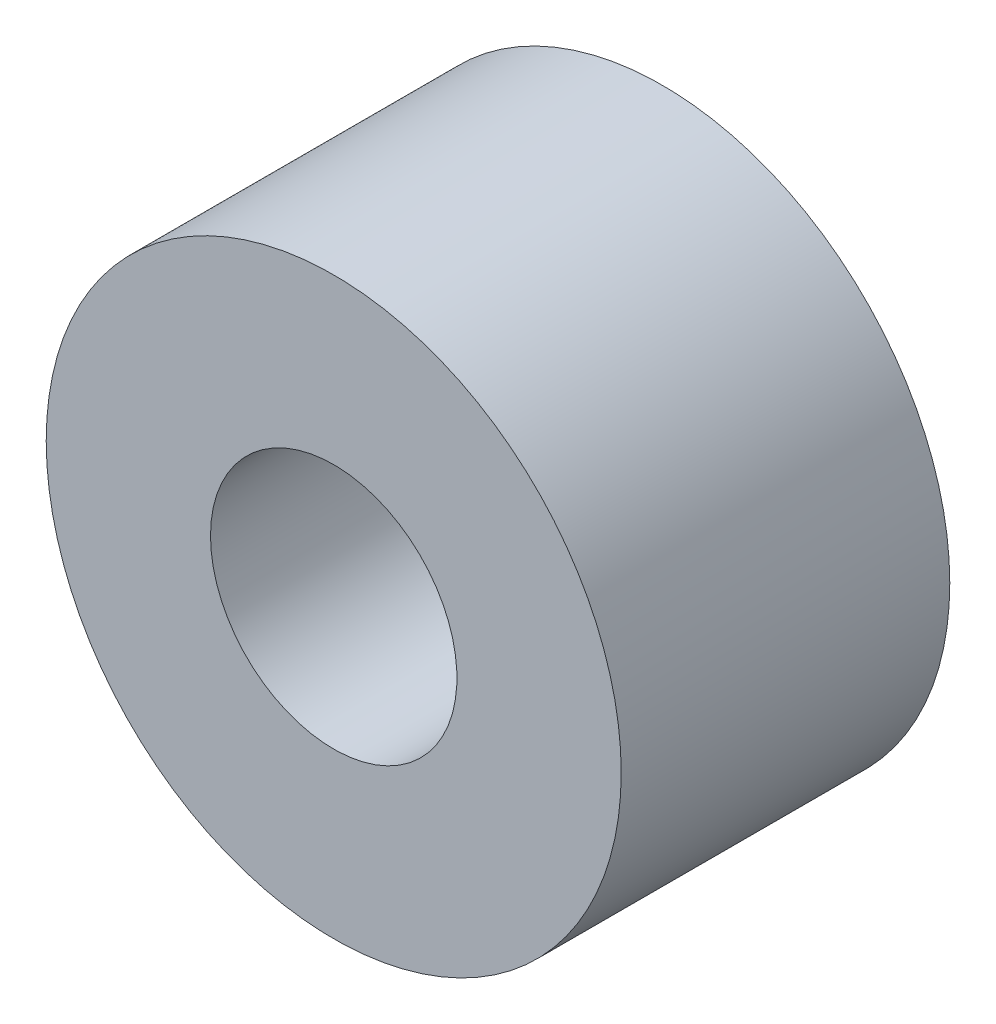
ISO-10303-21;
HEADER;
FILE_DESCRIPTION(('STEP AP214'),'2;1');
FILE_NAME('part.step','',(''),(''),'','','');
FILE_SCHEMA(('AUTOMOTIVE_DESIGN { 1 0 10303 214 1 1 1 1 }'));
ENDSEC;
DATA;
#1=APPLICATION_CONTEXT('core data for automotive mechanical design processes');
#2=APPLICATION_PROTOCOL_DEFINITION('international standard','automotive_design',2000,#1);
#3=PRODUCT_CONTEXT('',#1,'mechanical');
#4=PRODUCT('Part','Part','',(#3));
#5=PRODUCT_RELATED_PRODUCT_CATEGORY('part','',(#4));
#6=PRODUCT_DEFINITION_FORMATION('','',#4);
#7=PRODUCT_DEFINITION_CONTEXT('part definition',#1,'design');
#8=PRODUCT_DEFINITION('design','',#6,#7);
#9=PRODUCT_DEFINITION_SHAPE('','',#8);
#10=(LENGTH_UNIT() NAMED_UNIT(*) SI_UNIT(.MILLI.,.METRE.));
#11=(NAMED_UNIT(*) PLANE_ANGLE_UNIT() SI_UNIT($,.RADIAN.));
#12=(NAMED_UNIT(*) SI_UNIT($,.STERADIAN.) SOLID_ANGLE_UNIT());
#13=UNCERTAINTY_MEASURE_WITH_UNIT(LENGTH_MEASURE(1.E-05),#10,'distance_accuracy_value','');
#14=(GEOMETRIC_REPRESENTATION_CONTEXT(3) GLOBAL_UNCERTAINTY_ASSIGNED_CONTEXT((#13)) GLOBAL_UNIT_ASSIGNED_CONTEXT((#10,
#11,#12)) REPRESENTATION_CONTEXT('',''));
#15=CARTESIAN_POINT('',(0.,0.,0.));
#16=DIRECTION('',(0.,0.,1.));
#17=DIRECTION('',(1.,0.,0.));
#18=AXIS2_PLACEMENT_3D('',#15,#16,#17);
#19=CARTESIAN_POINT('',(0.,0.,4.));
#20=DIRECTION('',(0.,0.,-1.));
#21=DIRECTION('',(-1.,0.,0.));
#22=AXIS2_PLACEMENT_3D('',#19,#20,#21);
#23=CYLINDRICAL_SURFACE('',#22,1.5);
#24=CARTESIAN_POINT('',(0.,0.,0.));
#25=DIRECTION('',(0.,0.,-1.));
#26=DIRECTION('',(-1.,0.,0.));
#27=AXIS2_PLACEMENT_3D('',#24,#25,#26);
#28=CIRCLE('',#27,1.5);
#29=CARTESIAN_POINT('',(-1.5,0.,0.));
#30=VERTEX_POINT('',#29);
#31=EDGE_CURVE('E25',#30,#30,#28,.T.);
#32=ORIENTED_EDGE('',*,*,#31,.T.);
#33=EDGE_LOOP('',(#32));
#34=FACE_BOUND('',#33,.T.);
#35=CARTESIAN_POINT('',(0.,0.,4.));
#36=DIRECTION('',(0.,0.,-1.));
#37=DIRECTION('',(-1.,0.,0.));
#38=AXIS2_PLACEMENT_3D('',#35,#36,#37);
#39=CIRCLE('',#38,1.5);
#40=CARTESIAN_POINT('',(-1.5,0.,4.));
#41=VERTEX_POINT('',#40);
#42=EDGE_CURVE('E16',#41,#41,#39,.T.);
#43=ORIENTED_EDGE('',*,*,#42,.F.);
#44=EDGE_LOOP('',(#43));
#45=FACE_BOUND('',#44,.T.);
#46=ADVANCED_FACE('F13',(#34,#45),#23,.F.);
#47=CARTESIAN_POINT('',(0.,0.,4.));
#48=DIRECTION('',(0.,0.,1.));
#49=DIRECTION('',(1.,0.,0.));
#50=AXIS2_PLACEMENT_3D('',#47,#48,#49);
#51=PLANE('',#50);
#52=ORIENTED_EDGE('',*,*,#42,.T.);
#53=EDGE_LOOP('',(#52));
#54=FACE_BOUND('',#53,.T.);
#55=CARTESIAN_POINT('',(0.,0.,4.));
#56=DIRECTION('',(0.,0.,-1.));
#57=DIRECTION('',(-1.,0.,0.));
#58=AXIS2_PLACEMENT_3D('',#55,#56,#57);
#59=CIRCLE('',#58,3.5);
#60=CARTESIAN_POINT('',(-3.5,0.,4.));
#61=VERTEX_POINT('',#60);
#62=EDGE_CURVE('E20',#61,#61,#59,.T.);
#63=ORIENTED_EDGE('',*,*,#62,.F.);
#64=EDGE_LOOP('',(#63));
#65=FACE_BOUND('',#64,.T.);
#66=ADVANCED_FACE('F33',(#54,#65),#51,.T.);
#67=CARTESIAN_POINT('',(0.,0.,0.));
#68=DIRECTION('',(0.,0.,1.));
#69=DIRECTION('',(1.,0.,0.));
#70=AXIS2_PLACEMENT_3D('',#67,#68,#69);
#71=PLANE('',#70);
#72=ORIENTED_EDGE('',*,*,#31,.F.);
#73=EDGE_LOOP('',(#72));
#74=FACE_BOUND('',#73,.T.);
#75=CARTESIAN_POINT('',(0.,0.,0.));
#76=DIRECTION('',(0.,0.,-1.));
#77=DIRECTION('',(-1.,0.,0.));
#78=AXIS2_PLACEMENT_3D('',#75,#76,#77);
#79=CIRCLE('',#78,3.5);
#80=CARTESIAN_POINT('',(-3.5,0.,0.));
#81=VERTEX_POINT('',#80);
#82=EDGE_CURVE('E9',#81,#81,#79,.F.);
#83=ORIENTED_EDGE('',*,*,#82,.F.);
#84=EDGE_LOOP('',(#83));
#85=FACE_BOUND('',#84,.T.);
#86=ADVANCED_FACE('F41',(#74,#85),#71,.F.);
#87=CARTESIAN_POINT('',(0.,0.,4.));
#88=DIRECTION('',(0.,0.,-1.));
#89=DIRECTION('',(-1.,0.,0.));
#90=AXIS2_PLACEMENT_3D('',#87,#88,#89);
#91=CYLINDRICAL_SURFACE('',#90,3.5);
#92=ORIENTED_EDGE('',*,*,#82,.T.);
#93=EDGE_LOOP('',(#92));
#94=FACE_BOUND('',#93,.T.);
#95=ORIENTED_EDGE('',*,*,#62,.T.);
#96=EDGE_LOOP('',(#95));
#97=FACE_BOUND('',#96,.T.);
#98=ADVANCED_FACE('F42',(#94,#97),#91,.T.);
#99=CLOSED_SHELL('',(#46,#66,#86,#98));
#100=MANIFOLD_SOLID_BREP('B1',#99);
#101=ADVANCED_BREP_SHAPE_REPRESENTATION('',(#18,#100),#14);
#102=SHAPE_DEFINITION_REPRESENTATION(#9,#101);
ENDSEC;
END-ISO-10303-21;
